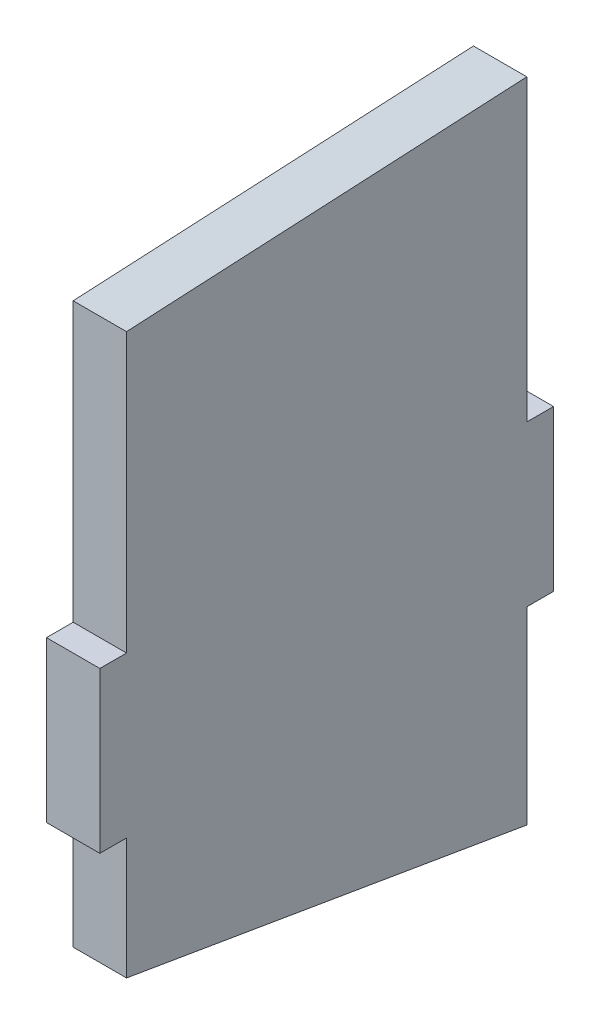
ISO-10303-21;
HEADER;
FILE_DESCRIPTION(('STEP AP214'),'2;1');
FILE_NAME('part.step','',(''),(''),'','','');
FILE_SCHEMA(('AUTOMOTIVE_DESIGN { 1 0 10303 214 1 1 1 1 }'));
ENDSEC;
DATA;
#1=APPLICATION_CONTEXT('core data for automotive mechanical design processes');
#2=APPLICATION_PROTOCOL_DEFINITION('international standard','automotive_design',2000,#1);
#3=PRODUCT_CONTEXT('',#1,'mechanical');
#4=PRODUCT('Part','Part','',(#3));
#5=PRODUCT_RELATED_PRODUCT_CATEGORY('part','',(#4));
#6=PRODUCT_DEFINITION_FORMATION('','',#4);
#7=PRODUCT_DEFINITION_CONTEXT('part definition',#1,'design');
#8=PRODUCT_DEFINITION('design','',#6,#7);
#9=PRODUCT_DEFINITION_SHAPE('','',#8);
#10=(LENGTH_UNIT() NAMED_UNIT(*) SI_UNIT(.MILLI.,.METRE.));
#11=(NAMED_UNIT(*) PLANE_ANGLE_UNIT() SI_UNIT($,.RADIAN.));
#12=(NAMED_UNIT(*) SI_UNIT($,.STERADIAN.) SOLID_ANGLE_UNIT());
#13=UNCERTAINTY_MEASURE_WITH_UNIT(LENGTH_MEASURE(1.E-05),#10,'distance_accuracy_value','');
#14=(GEOMETRIC_REPRESENTATION_CONTEXT(3) GLOBAL_UNCERTAINTY_ASSIGNED_CONTEXT((#13)) GLOBAL_UNIT_ASSIGNED_CONTEXT((#10,
#11,#12)) REPRESENTATION_CONTEXT('',''));
#15=CARTESIAN_POINT('',(0.,0.,0.));
#16=DIRECTION('',(0.,0.,1.));
#17=DIRECTION('',(1.,0.,0.));
#18=AXIS2_PLACEMENT_3D('',#15,#16,#17);
#19=CARTESIAN_POINT('',(25.4,0.,95.25));
#20=DIRECTION('',(0.,0.,1.));
#21=DIRECTION('',(1.,0.,0.));
#22=AXIS2_PLACEMENT_3D('',#19,#20,#21);
#23=PLANE('',#22);
#24=DIRECTION('',(0.,1.,0.));
#25=VECTOR('',#24,1.);
#26=CARTESIAN_POINT('',(0.,0.,95.25));
#27=LINE('',#26,#25);
#28=CARTESIAN_POINT('',(0.,38.1,95.25));
#29=VERTEX_POINT('',#28);
#30=CARTESIAN_POINT('',(0.,170.563269744,95.25));
#31=VERTEX_POINT('',#30);
#32=EDGE_CURVE('E159',#29,#31,#27,.T.);
#33=ORIENTED_EDGE('',*,*,#32,.F.);
#34=DIRECTION('',(-1.,0.,0.));
#35=VECTOR('',#34,1.);
#36=CARTESIAN_POINT('',(25.4,38.1,95.25));
#37=LINE('',#36,#35);
#38=CARTESIAN_POINT('',(25.4,38.1,95.25));
#39=VERTEX_POINT('',#38);
#40=EDGE_CURVE('E11',#39,#29,#37,.T.);
#41=ORIENTED_EDGE('',*,*,#40,.F.);
#42=DIRECTION('',(0.,1.,0.));
#43=VECTOR('',#42,1.);
#44=CARTESIAN_POINT('',(25.4,0.,95.25));
#45=LINE('',#44,#43);
#46=CARTESIAN_POINT('',(25.4,170.563269744,95.25));
#47=VERTEX_POINT('',#46);
#48=EDGE_CURVE('E188',#39,#47,#45,.T.);
#49=ORIENTED_EDGE('',*,*,#48,.T.);
#50=DIRECTION('',(-1.,0.,0.));
#51=VECTOR('',#50,1.);
#52=CARTESIAN_POINT('',(25.4,170.563269744,95.25));
#53=LINE('',#52,#51);
#54=EDGE_CURVE('E57',#47,#31,#53,.T.);
#55=ORIENTED_EDGE('',*,*,#54,.T.);
#56=EDGE_LOOP('',(#33,#41,#49,#55));
#57=FACE_BOUND('',#56,.T.);
#58=ADVANCED_FACE('F41',(#57),#23,.T.);
#59=CARTESIAN_POINT('',(25.4,38.1,0.));
#60=DIRECTION('',(0.,1.,0.));
#61=DIRECTION('',(0.,0.,1.));
#62=AXIS2_PLACEMENT_3D('',#59,#60,#61);
#63=PLANE('',#62);
#64=DIRECTION('',(0.,0.,-1.));
#65=VECTOR('',#64,1.);
#66=CARTESIAN_POINT('',(0.,38.1,0.));
#67=LINE('',#66,#65);
#68=CARTESIAN_POINT('',(0.,38.1,107.95));
#69=VERTEX_POINT('',#68);
#70=EDGE_CURVE('E161',#69,#29,#67,.T.);
#71=ORIENTED_EDGE('',*,*,#70,.F.);
#72=DIRECTION('',(-1.,0.,0.));
#73=VECTOR('',#72,1.);
#74=CARTESIAN_POINT('',(25.4,38.1,107.95));
#75=LINE('',#74,#73);
#76=CARTESIAN_POINT('',(25.4,38.1,107.95));
#77=VERTEX_POINT('',#76);
#78=EDGE_CURVE('E49',#77,#69,#75,.T.);
#79=ORIENTED_EDGE('',*,*,#78,.F.);
#80=DIRECTION('',(0.,0.,-1.));
#81=VECTOR('',#80,1.);
#82=CARTESIAN_POINT('',(25.4,38.1,0.));
#83=LINE('',#82,#81);
#84=EDGE_CURVE('E231',#77,#39,#83,.T.);
#85=ORIENTED_EDGE('',*,*,#84,.T.);
#86=ORIENTED_EDGE('',*,*,#40,.T.);
#87=EDGE_LOOP('',(#71,#79,#85,#86));
#88=FACE_BOUND('',#87,.T.);
#89=ADVANCED_FACE('F216',(#88),#63,.T.);
#90=CARTESIAN_POINT('',(25.4,0.,107.95));
#91=DIRECTION('',(0.,0.,1.));
#92=DIRECTION('',(1.,0.,0.));
#93=AXIS2_PLACEMENT_3D('',#90,#91,#92);
#94=PLANE('',#93);
#95=DIRECTION('',(0.,1.,0.));
#96=VECTOR('',#95,1.);
#97=CARTESIAN_POINT('',(0.,0.,107.95));
#98=LINE('',#97,#96);
#99=CARTESIAN_POINT('',(0.,-38.1,107.95));
#100=VERTEX_POINT('',#99);
#101=EDGE_CURVE('E164',#100,#69,#98,.T.);
#102=ORIENTED_EDGE('',*,*,#101,.F.);
#103=DIRECTION('',(-1.,0.,0.));
#104=VECTOR('',#103,1.);
#105=CARTESIAN_POINT('',(25.4,-38.1,107.95));
#106=LINE('',#105,#104);
#107=CARTESIAN_POINT('',(25.4,-38.1,107.95));
#108=VERTEX_POINT('',#107);
#109=EDGE_CURVE('E205',#108,#100,#106,.T.);
#110=ORIENTED_EDGE('',*,*,#109,.F.);
#111=DIRECTION('',(0.,1.,0.));
#112=VECTOR('',#111,1.);
#113=CARTESIAN_POINT('',(25.4,0.,107.95));
#114=LINE('',#113,#112);
#115=EDGE_CURVE('E212',#108,#77,#114,.T.);
#116=ORIENTED_EDGE('',*,*,#115,.T.);
#117=ORIENTED_EDGE('',*,*,#78,.T.);
#118=EDGE_LOOP('',(#102,#110,#116,#117));
#119=FACE_BOUND('',#118,.T.);
#120=ADVANCED_FACE('F210',(#119),#94,.T.);
#121=CARTESIAN_POINT('',(25.4,-38.1,0.));
#122=DIRECTION('',(0.,1.,0.));
#123=DIRECTION('',(0.,0.,1.));
#124=AXIS2_PLACEMENT_3D('',#121,#122,#123);
#125=PLANE('',#124);
#126=DIRECTION('',(0.,0.,-1.));
#127=VECTOR('',#126,1.);
#128=CARTESIAN_POINT('',(0.,-38.1,0.));
#129=LINE('',#128,#127);
#130=CARTESIAN_POINT('',(0.,-38.1,95.25));
#131=VERTEX_POINT('',#130);
#132=EDGE_CURVE('E167',#100,#131,#129,.T.);
#133=ORIENTED_EDGE('',*,*,#132,.T.);
#134=DIRECTION('',(-1.,0.,0.));
#135=VECTOR('',#134,1.);
#136=CARTESIAN_POINT('',(25.4,-38.1,95.25));
#137=LINE('',#136,#135);
#138=CARTESIAN_POINT('',(25.4,-38.1,95.25));
#139=VERTEX_POINT('',#138);
#140=EDGE_CURVE('E203',#139,#131,#137,.T.);
#141=ORIENTED_EDGE('',*,*,#140,.F.);
#142=DIRECTION('',(0.,0.,-1.));
#143=VECTOR('',#142,1.);
#144=CARTESIAN_POINT('',(25.4,-38.1,0.));
#145=LINE('',#144,#143);
#146=EDGE_CURVE('E227',#108,#139,#145,.T.);
#147=ORIENTED_EDGE('',*,*,#146,.F.);
#148=ORIENTED_EDGE('',*,*,#109,.T.);
#149=EDGE_LOOP('',(#133,#141,#147,#148));
#150=FACE_BOUND('',#149,.T.);
#151=ADVANCED_FACE('F224',(#150),#125,.F.);
#152=CARTESIAN_POINT('',(25.4,0.,95.25));
#153=DIRECTION('',(0.,0.,1.));
#154=DIRECTION('',(1.,0.,0.));
#155=AXIS2_PLACEMENT_3D('',#152,#153,#154);
#156=PLANE('',#155);
#157=DIRECTION('',(0.,1.,0.));
#158=VECTOR('',#157,1.);
#159=CARTESIAN_POINT('',(0.,0.,95.25));
#160=LINE('',#159,#158);
#161=CARTESIAN_POINT('',(0.,-95.823816988,95.25));
#162=VERTEX_POINT('',#161);
#163=EDGE_CURVE('E170',#162,#131,#160,.T.);
#164=ORIENTED_EDGE('',*,*,#163,.F.);
#165=DIRECTION('',(-1.,0.,0.));
#166=VECTOR('',#165,1.);
#167=CARTESIAN_POINT('',(25.4,-95.823816988,95.25));
#168=LINE('',#167,#166);
#169=CARTESIAN_POINT('',(25.4,-95.823816988,95.25));
#170=VERTEX_POINT('',#169);
#171=EDGE_CURVE('E201',#170,#162,#168,.T.);
#172=ORIENTED_EDGE('',*,*,#171,.F.);
#173=DIRECTION('',(0.,1.,0.));
#174=VECTOR('',#173,1.);
#175=CARTESIAN_POINT('',(25.4,0.,95.25));
#176=LINE('',#175,#174);
#177=EDGE_CURVE('E229',#170,#139,#176,.T.);
#178=ORIENTED_EDGE('',*,*,#177,.T.);
#179=ORIENTED_EDGE('',*,*,#140,.T.);
#180=EDGE_LOOP('',(#164,#172,#178,#179));
#181=FACE_BOUND('',#180,.T.);
#182=ADVANCED_FACE('F271',(#181),#156,.T.);
#183=CARTESIAN_POINT('',(25.4,-108.816607321183,18.3964307345098));
#184=DIRECTION('',(0.,0.986008729811554,-0.166693685349526));
#185=DIRECTION('',(0.,0.166693685349526,0.986008729811554));
#186=AXIS2_PLACEMENT_3D('',#183,#184,#185);
#187=PLANE('',#186);
#188=DIRECTION('',(0.,-0.166693685349526,-0.986008729811554));
#189=VECTOR('',#188,1.);
#190=CARTESIAN_POINT('',(0.,-108.816607321183,18.3964307345098));
#191=LINE('',#190,#189);
#192=CARTESIAN_POINT('',(0.,-128.029563346,-95.25));
#193=VERTEX_POINT('',#192);
#194=EDGE_CURVE('E173',#162,#193,#191,.T.);
#195=ORIENTED_EDGE('',*,*,#194,.T.);
#196=DIRECTION('',(-1.,0.,0.));
#197=VECTOR('',#196,1.);
#198=CARTESIAN_POINT('',(25.4,-128.029563346,-95.25));
#199=LINE('',#198,#197);
#200=CARTESIAN_POINT('',(25.4,-128.029563346,-95.25));
#201=VERTEX_POINT('',#200);
#202=EDGE_CURVE('E198',#201,#193,#199,.T.);
#203=ORIENTED_EDGE('',*,*,#202,.F.);
#204=DIRECTION('',(0.,-0.166693685349526,-0.986008729811554));
#205=VECTOR('',#204,1.);
#206=CARTESIAN_POINT('',(25.4,-108.816607321183,18.3964307345098));
#207=LINE('',#206,#205);
#208=EDGE_CURVE('E237',#170,#201,#207,.T.);
#209=ORIENTED_EDGE('',*,*,#208,.F.);
#210=ORIENTED_EDGE('',*,*,#171,.T.);
#211=EDGE_LOOP('',(#195,#203,#209,#210));
#212=FACE_BOUND('',#211,.T.);
#213=ADVANCED_FACE('F274',(#212),#187,.F.);
#214=CARTESIAN_POINT('',(25.4,0.,-95.25));
#215=DIRECTION('',(0.,0.,1.));
#216=DIRECTION('',(1.,0.,0.));
#217=AXIS2_PLACEMENT_3D('',#214,#215,#216);
#218=PLANE('',#217);
#219=DIRECTION('',(0.,1.,0.));
#220=VECTOR('',#219,1.);
#221=CARTESIAN_POINT('',(0.,0.,-95.25));
#222=LINE('',#221,#220);
#223=CARTESIAN_POINT('',(0.,-38.1,-95.25));
#224=VERTEX_POINT('',#223);
#225=EDGE_CURVE('E175',#193,#224,#222,.T.);
#226=ORIENTED_EDGE('',*,*,#225,.T.);
#227=DIRECTION('',(-1.,0.,0.));
#228=VECTOR('',#227,1.);
#229=CARTESIAN_POINT('',(25.4,-38.1,-95.25));
#230=LINE('',#229,#228);
#231=CARTESIAN_POINT('',(25.4,-38.1,-95.25));
#232=VERTEX_POINT('',#231);
#233=EDGE_CURVE('E195',#232,#224,#230,.T.);
#234=ORIENTED_EDGE('',*,*,#233,.F.);
#235=DIRECTION('',(0.,1.,0.));
#236=VECTOR('',#235,1.);
#237=CARTESIAN_POINT('',(25.4,0.,-95.25));
#238=LINE('',#237,#236);
#239=EDGE_CURVE('E239',#201,#232,#238,.T.);
#240=ORIENTED_EDGE('',*,*,#239,.F.);
#241=ORIENTED_EDGE('',*,*,#202,.T.);
#242=EDGE_LOOP('',(#226,#234,#240,#241));
#243=FACE_BOUND('',#242,.T.);
#244=ADVANCED_FACE('F278',(#243),#218,.F.);
#245=CARTESIAN_POINT('',(25.4,-38.1,0.));
#246=DIRECTION('',(0.,1.,0.));
#247=DIRECTION('',(0.,0.,1.));
#248=AXIS2_PLACEMENT_3D('',#245,#246,#247);
#249=PLANE('',#248);
#250=DIRECTION('',(0.,0.,-1.));
#251=VECTOR('',#250,1.);
#252=CARTESIAN_POINT('',(0.,-38.1,0.));
#253=LINE('',#252,#251);
#254=CARTESIAN_POINT('',(0.,-38.1,-107.95));
#255=VERTEX_POINT('',#254);
#256=EDGE_CURVE('E177',#224,#255,#253,.T.);
#257=ORIENTED_EDGE('',*,*,#256,.T.);
#258=DIRECTION('',(-1.,0.,0.));
#259=VECTOR('',#258,1.);
#260=CARTESIAN_POINT('',(25.4,-38.1,-107.95));
#261=LINE('',#260,#259);
#262=CARTESIAN_POINT('',(25.4,-38.1,-107.95));
#263=VERTEX_POINT('',#262);
#264=EDGE_CURVE('E192',#263,#255,#261,.T.);
#265=ORIENTED_EDGE('',*,*,#264,.F.);
#266=DIRECTION('',(0.,0.,-1.));
#267=VECTOR('',#266,1.);
#268=CARTESIAN_POINT('',(25.4,-38.1,0.));
#269=LINE('',#268,#267);
#270=EDGE_CURVE('E154',#232,#263,#269,.T.);
#271=ORIENTED_EDGE('',*,*,#270,.F.);
#272=ORIENTED_EDGE('',*,*,#233,.T.);
#273=EDGE_LOOP('',(#257,#265,#271,#272));
#274=FACE_BOUND('',#273,.T.);
#275=ADVANCED_FACE('F245',(#274),#249,.F.);
#276=CARTESIAN_POINT('',(25.4,0.,-107.95));
#277=DIRECTION('',(0.,0.,1.));
#278=DIRECTION('',(1.,0.,0.));
#279=AXIS2_PLACEMENT_3D('',#276,#277,#278);
#280=PLANE('',#279);
#281=DIRECTION('',(0.,1.,0.));
#282=VECTOR('',#281,1.);
#283=CARTESIAN_POINT('',(0.,0.,-107.95));
#284=LINE('',#283,#282);
#285=CARTESIAN_POINT('',(0.,38.1,-107.95));
#286=VERTEX_POINT('',#285);
#287=EDGE_CURVE('E179',#255,#286,#284,.T.);
#288=ORIENTED_EDGE('',*,*,#287,.T.);
#289=DIRECTION('',(-1.,0.,0.));
#290=VECTOR('',#289,1.);
#291=CARTESIAN_POINT('',(25.4,38.1,-107.95));
#292=LINE('',#291,#290);
#293=CARTESIAN_POINT('',(25.4,38.1,-107.95));
#294=VERTEX_POINT('',#293);
#295=EDGE_CURVE('E141',#294,#286,#292,.T.);
#296=ORIENTED_EDGE('',*,*,#295,.F.);
#297=DIRECTION('',(0.,1.,0.));
#298=VECTOR('',#297,1.);
#299=CARTESIAN_POINT('',(25.4,0.,-107.95));
#300=LINE('',#299,#298);
#301=EDGE_CURVE('E151',#263,#294,#300,.T.);
#302=ORIENTED_EDGE('',*,*,#301,.F.);
#303=ORIENTED_EDGE('',*,*,#264,.T.);
#304=EDGE_LOOP('',(#288,#296,#302,#303));
#305=FACE_BOUND('',#304,.T.);
#306=ADVANCED_FACE('F249',(#305),#280,.F.);
#307=CARTESIAN_POINT('',(25.4,38.1,0.));
#308=DIRECTION('',(0.,1.,0.));
#309=DIRECTION('',(0.,0.,1.));
#310=AXIS2_PLACEMENT_3D('',#307,#308,#309);
#311=PLANE('',#310);
#312=DIRECTION('',(0.,0.,-1.));
#313=VECTOR('',#312,1.);
#314=CARTESIAN_POINT('',(0.,38.1,0.));
#315=LINE('',#314,#313);
#316=CARTESIAN_POINT('',(0.,38.1,-95.25));
#317=VERTEX_POINT('',#316);
#318=EDGE_CURVE('E138',#317,#286,#315,.T.);
#319=ORIENTED_EDGE('',*,*,#318,.F.);
#320=DIRECTION('',(-1.,0.,0.));
#321=VECTOR('',#320,1.);
#322=CARTESIAN_POINT('',(25.4,38.1,-95.25));
#323=LINE('',#322,#321);
#324=CARTESIAN_POINT('',(25.4,38.1,-95.25));
#325=VERTEX_POINT('',#324);
#326=EDGE_CURVE('E132',#325,#317,#323,.T.);
#327=ORIENTED_EDGE('',*,*,#326,.F.);
#328=DIRECTION('',(0.,0.,-1.));
#329=VECTOR('',#328,1.);
#330=CARTESIAN_POINT('',(25.4,38.1,0.));
#331=LINE('',#330,#329);
#332=EDGE_CURVE('E136',#325,#294,#331,.T.);
#333=ORIENTED_EDGE('',*,*,#332,.T.);
#334=ORIENTED_EDGE('',*,*,#295,.T.);
#335=EDGE_LOOP('',(#319,#327,#333,#334));
#336=FACE_BOUND('',#335,.T.);
#337=ADVANCED_FACE('F134',(#336),#311,.T.);
#338=CARTESIAN_POINT('',(25.4,0.,-95.25));
#339=DIRECTION('',(0.,0.,1.));
#340=DIRECTION('',(1.,0.,0.));
#341=AXIS2_PLACEMENT_3D('',#338,#339,#340);
#342=PLANE('',#341);
#343=DIRECTION('',(0.,1.,0.));
#344=VECTOR('',#343,1.);
#345=CARTESIAN_POINT('',(0.,0.,-95.25));
#346=LINE('',#345,#344);
#347=CARTESIAN_POINT('',(0.,180.323740444,-95.25));
#348=VERTEX_POINT('',#347);
#349=EDGE_CURVE('E183',#317,#348,#346,.T.);
#350=ORIENTED_EDGE('',*,*,#349,.T.);
#351=DIRECTION('',(-1.,0.,0.));
#352=VECTOR('',#351,1.);
#353=CARTESIAN_POINT('',(25.4,180.323740444,-95.25));
#354=LINE('',#353,#352);
#355=CARTESIAN_POINT('',(25.4,180.323740444,-95.25));
#356=VERTEX_POINT('',#355);
#357=EDGE_CURVE('E95',#356,#348,#354,.T.);
#358=ORIENTED_EDGE('',*,*,#357,.F.);
#359=DIRECTION('',(0.,1.,0.));
#360=VECTOR('',#359,1.);
#361=CARTESIAN_POINT('',(25.4,0.,-95.25));
#362=LINE('',#361,#360);
#363=EDGE_CURVE('E143',#325,#356,#362,.T.);
#364=ORIENTED_EDGE('',*,*,#363,.F.);
#365=ORIENTED_EDGE('',*,*,#326,.T.);
#366=EDGE_LOOP('',(#350,#358,#364,#365));
#367=FACE_BOUND('',#366,.T.);
#368=ADVANCED_FACE('F144',(#367),#342,.F.);
#369=CARTESIAN_POINT('',(25.4,174.984148164892,8.96549948098629));
#370=DIRECTION('',(0.,0.998690011345117,0.0511689480006125));
#371=DIRECTION('',(0.,-0.0511689480006125,0.998690011345117));
#372=AXIS2_PLACEMENT_3D('',#369,#370,#371);
#373=PLANE('',#372);
#374=DIRECTION('',(0.,0.0511689480006125,-0.998690011345117));
#375=VECTOR('',#374,1.);
#376=CARTESIAN_POINT('',(0.,174.984148164892,8.96549948098629));
#377=LINE('',#376,#375);
#378=EDGE_CURVE('E185',#31,#348,#377,.T.);
#379=ORIENTED_EDGE('',*,*,#378,.F.);
#380=ORIENTED_EDGE('',*,*,#54,.F.);
#381=DIRECTION('',(0.,0.0511689480006125,-0.998690011345117));
#382=VECTOR('',#381,1.);
#383=CARTESIAN_POINT('',(25.4,174.984148164892,8.96549948098629));
#384=LINE('',#383,#382);
#385=EDGE_CURVE('E147',#47,#356,#384,.T.);
#386=ORIENTED_EDGE('',*,*,#385,.T.);
#387=ORIENTED_EDGE('',*,*,#357,.T.);
#388=EDGE_LOOP('',(#379,#380,#386,#387));
#389=FACE_BOUND('',#388,.T.);
#390=ADVANCED_FACE('F250',(#389),#373,.T.);
#391=CARTESIAN_POINT('',(25.4,0.,0.));
#392=DIRECTION('',(1.,0.,0.));
#393=DIRECTION('',(0.,0.,-1.));
#394=AXIS2_PLACEMENT_3D('',#391,#392,#393);
#395=PLANE('',#394);
#396=ORIENTED_EDGE('',*,*,#48,.F.);
#397=ORIENTED_EDGE('',*,*,#84,.F.);
#398=ORIENTED_EDGE('',*,*,#115,.F.);
#399=ORIENTED_EDGE('',*,*,#146,.T.);
#400=ORIENTED_EDGE('',*,*,#177,.F.);
#401=ORIENTED_EDGE('',*,*,#208,.T.);
#402=ORIENTED_EDGE('',*,*,#239,.T.);
#403=ORIENTED_EDGE('',*,*,#270,.T.);
#404=ORIENTED_EDGE('',*,*,#301,.T.);
#405=ORIENTED_EDGE('',*,*,#332,.F.);
#406=ORIENTED_EDGE('',*,*,#363,.T.);
#407=ORIENTED_EDGE('',*,*,#385,.F.);
#408=EDGE_LOOP('',(#396,#397,#398,#399,#400,#401,#402,#403,#404,#405,#406,#407));
#409=FACE_BOUND('',#408,.T.);
#410=ADVANCED_FACE('F149',(#409),#395,.T.);
#411=CARTESIAN_POINT('',(0.,0.,0.));
#412=DIRECTION('',(1.,0.,0.));
#413=DIRECTION('',(0.,0.,-1.));
#414=AXIS2_PLACEMENT_3D('',#411,#412,#413);
#415=PLANE('',#414);
#416=ORIENTED_EDGE('',*,*,#32,.T.);
#417=ORIENTED_EDGE('',*,*,#378,.T.);
#418=ORIENTED_EDGE('',*,*,#349,.F.);
#419=ORIENTED_EDGE('',*,*,#318,.T.);
#420=ORIENTED_EDGE('',*,*,#287,.F.);
#421=ORIENTED_EDGE('',*,*,#256,.F.);
#422=ORIENTED_EDGE('',*,*,#225,.F.);
#423=ORIENTED_EDGE('',*,*,#194,.F.);
#424=ORIENTED_EDGE('',*,*,#163,.T.);
#425=ORIENTED_EDGE('',*,*,#132,.F.);
#426=ORIENTED_EDGE('',*,*,#101,.T.);
#427=ORIENTED_EDGE('',*,*,#70,.T.);
#428=EDGE_LOOP('',(#416,#417,#418,#419,#420,#421,#422,#423,#424,#425,#426,#427));
#429=FACE_BOUND('',#428,.T.);
#430=ADVANCED_FACE('F219',(#429),#415,.F.);
#431=CLOSED_SHELL('',(#58,#89,#120,#151,#182,#213,#244,#275,#306,#337,#368,#390,#410,#430));
#432=MANIFOLD_SOLID_BREP('B2',#431);
#433=ADVANCED_BREP_SHAPE_REPRESENTATION('',(#18,#432),#14);
#434=SHAPE_DEFINITION_REPRESENTATION(#9,#433);
ENDSEC;
END-ISO-10303-21;
